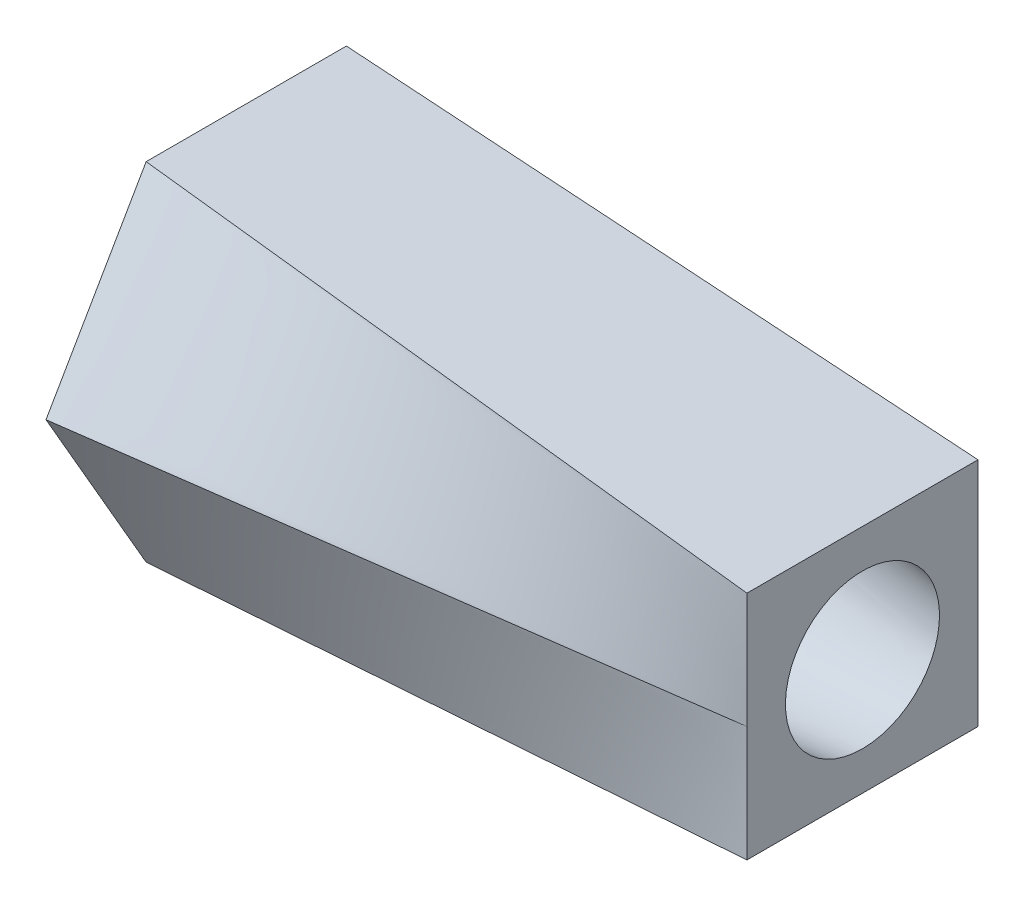
ISO-10303-21;
HEADER;
FILE_DESCRIPTION(('STEP AP214'),'2;1');
FILE_NAME('part.step','',(''),(''),'','','');
FILE_SCHEMA(('AUTOMOTIVE_DESIGN { 1 0 10303 214 1 1 1 1 }'));
ENDSEC;
DATA;
#1=APPLICATION_CONTEXT('core data for automotive mechanical design processes');
#2=APPLICATION_PROTOCOL_DEFINITION('international standard','automotive_design',2000,#1);
#3=PRODUCT_CONTEXT('',#1,'mechanical');
#4=PRODUCT('Part','Part','',(#3));
#5=PRODUCT_RELATED_PRODUCT_CATEGORY('part','',(#4));
#6=PRODUCT_DEFINITION_FORMATION('','',#4);
#7=PRODUCT_DEFINITION_CONTEXT('part definition',#1,'design');
#8=PRODUCT_DEFINITION('design','',#6,#7);
#9=PRODUCT_DEFINITION_SHAPE('','',#8);
#10=(LENGTH_UNIT() NAMED_UNIT(*) SI_UNIT(.MILLI.,.METRE.));
#11=(NAMED_UNIT(*) PLANE_ANGLE_UNIT() SI_UNIT($,.RADIAN.));
#12=(NAMED_UNIT(*) SI_UNIT($,.STERADIAN.) SOLID_ANGLE_UNIT());
#13=UNCERTAINTY_MEASURE_WITH_UNIT(LENGTH_MEASURE(1.E-05),#10,'distance_accuracy_value','');
#14=(GEOMETRIC_REPRESENTATION_CONTEXT(3) GLOBAL_UNCERTAINTY_ASSIGNED_CONTEXT((#13)) GLOBAL_UNIT_ASSIGNED_CONTEXT((#10,
#11,#12)) REPRESENTATION_CONTEXT('',''));
#15=CARTESIAN_POINT('',(0.,0.,0.));
#16=DIRECTION('',(0.,0.,1.));
#17=DIRECTION('',(1.,0.,0.));
#18=AXIS2_PLACEMENT_3D('',#15,#16,#17);
#19=CARTESIAN_POINT('',(0.,0.,0.));
#20=DIRECTION('',(1.,0.,0.));
#21=DIRECTION('',(0.,0.,-1.));
#22=AXIS2_PLACEMENT_3D('',#19,#20,#21);
#23=PLANE('',#22);
#24=CARTESIAN_POINT('',(0.,0.,0.));
#25=DIRECTION('',(-1.,0.,0.));
#26=DIRECTION('',(0.,0.,1.));
#27=AXIS2_PLACEMENT_3D('',#24,#25,#26);
#28=CIRCLE('',#27,50.);
#29=CARTESIAN_POINT('',(0.,3.26493166648178,-49.8932883383447));
#30=VERTEX_POINT('',#29);
#31=EDGE_CURVE('E144',#30,#30,#28,.T.);
#32=ORIENTED_EDGE('',*,*,#31,.F.);
#33=EDGE_LOOP('',(#32));
#34=FACE_BOUND('',#33,.T.);
#35=DIRECTION('',(0.,-0.866025403784438,-0.5));
#36=VECTOR('',#35,1.);
#37=CARTESIAN_POINT('',(0.,0.,65.));
#38=LINE('',#37,#36);
#39=CARTESIAN_POINT('',(0.,0.,65.));
#40=VERTEX_POINT('',#39);
#41=CARTESIAN_POINT('',(0.,-56.2916512459885,32.5));
#42=VERTEX_POINT('',#41);
#43=EDGE_CURVE('E116',#40,#42,#38,.T.);
#44=ORIENTED_EDGE('',*,*,#43,.F.);
#45=DIRECTION('',(0.,-0.866025403784439,0.5));
#46=VECTOR('',#45,1.);
#47=CARTESIAN_POINT('',(0.,56.2916512459885,32.5));
#48=LINE('',#47,#46);
#49=CARTESIAN_POINT('',(0.,56.2916512459885,32.5));
#50=VERTEX_POINT('',#49);
#51=EDGE_CURVE('E12',#50,#40,#48,.T.);
#52=ORIENTED_EDGE('',*,*,#51,.F.);
#53=DIRECTION('',(0.,0.,1.));
#54=VECTOR('',#53,1.);
#55=CARTESIAN_POINT('',(0.,56.2916512459885,-32.5));
#56=LINE('',#55,#54);
#57=CARTESIAN_POINT('',(0.,56.2916512459885,-32.5));
#58=VERTEX_POINT('',#57);
#59=EDGE_CURVE('E65',#58,#50,#56,.T.);
#60=ORIENTED_EDGE('',*,*,#59,.F.);
#61=DIRECTION('',(0.,0.866025403784438,0.500000000000001));
#62=VECTOR('',#61,1.);
#63=CARTESIAN_POINT('',(0.,0.,-65.));
#64=LINE('',#63,#62);
#65=CARTESIAN_POINT('',(0.,0.,-65.));
#66=VERTEX_POINT('',#65);
#67=EDGE_CURVE('E383',#66,#58,#64,.T.);
#68=ORIENTED_EDGE('',*,*,#67,.F.);
#69=DIRECTION('',(0.,0.866025403784439,-0.5));
#70=VECTOR('',#69,1.);
#71=CARTESIAN_POINT('',(0.,-56.2916512459885,-32.5));
#72=LINE('',#71,#70);
#73=CARTESIAN_POINT('',(0.,-56.2916512459885,-32.5));
#74=VERTEX_POINT('',#73);
#75=EDGE_CURVE('E393',#74,#66,#72,.T.);
#76=ORIENTED_EDGE('',*,*,#75,.F.);
#77=DIRECTION('',(0.,0.,-1.));
#78=VECTOR('',#77,1.);
#79=CARTESIAN_POINT('',(0.,-56.2916512459885,32.5));
#80=LINE('',#79,#78);
#81=EDGE_CURVE('E245',#42,#74,#80,.T.);
#82=ORIENTED_EDGE('',*,*,#81,.F.);
#83=EDGE_LOOP('',(#44,#52,#60,#68,#76,#82));
#84=FACE_BOUND('',#83,.T.);
#85=ADVANCED_FACE('F54',(#34,#84),#23,.F.);
#86=CARTESIAN_POINT('',(200.,0.,0.));
#87=DIRECTION('',(-1.,0.,0.));
#88=DIRECTION('',(0.,0.,1.));
#89=AXIS2_PLACEMENT_3D('',#86,#87,#88);
#90=PLANE('',#89);
#91=CARTESIAN_POINT('',(200.,0.,0.));
#92=DIRECTION('',(1.,0.,0.));
#93=DIRECTION('',(0.,0.,-1.));
#94=AXIS2_PLACEMENT_3D('',#91,#92,#93);
#95=CIRCLE('',#94,25.);
#96=CARTESIAN_POINT('',(200.,-8.20188431319086,-23.6162887370779));
#97=VERTEX_POINT('',#96);
#98=EDGE_CURVE('E407',#97,#97,#95,.T.);
#99=ORIENTED_EDGE('',*,*,#98,.F.);
#100=EDGE_LOOP('',(#99));
#101=FACE_BOUND('',#100,.T.);
#102=DIRECTION('',(0.,-1.,0.));
#103=VECTOR('',#102,1.);
#104=CARTESIAN_POINT('',(200.,37.5,37.5));
#105=LINE('',#104,#103);
#106=CARTESIAN_POINT('',(200.,37.5,37.5));
#107=VERTEX_POINT('',#106);
#108=CARTESIAN_POINT('',(200.,0.,37.5));
#109=VERTEX_POINT('',#108);
#110=EDGE_CURVE('E141',#107,#109,#105,.T.);
#111=ORIENTED_EDGE('',*,*,#110,.T.);
#112=CARTESIAN_POINT('',(200.,-37.5,37.5));
#113=VERTEX_POINT('',#112);
#114=EDGE_CURVE('E114',#109,#113,#105,.T.);
#115=ORIENTED_EDGE('',*,*,#114,.T.);
#116=DIRECTION('',(0.,0.,-1.));
#117=VECTOR('',#116,1.);
#118=CARTESIAN_POINT('',(200.,-37.5,-37.5));
#119=LINE('',#118,#117);
#120=CARTESIAN_POINT('',(200.,-37.5,0.));
#121=VERTEX_POINT('',#120);
#122=EDGE_CURVE('E124',#113,#121,#119,.T.);
#123=ORIENTED_EDGE('',*,*,#122,.T.);
#124=CARTESIAN_POINT('',(200.,-37.5,-37.5));
#125=VERTEX_POINT('',#124);
#126=EDGE_CURVE('E134',#121,#125,#119,.T.);
#127=ORIENTED_EDGE('',*,*,#126,.T.);
#128=DIRECTION('',(0.,1.,0.));
#129=VECTOR('',#128,1.);
#130=CARTESIAN_POINT('',(200.,37.5,-37.5));
#131=LINE('',#130,#129);
#132=CARTESIAN_POINT('',(200.,37.5,-37.5));
#133=VERTEX_POINT('',#132);
#134=EDGE_CURVE('E133',#125,#133,#131,.T.);
#135=ORIENTED_EDGE('',*,*,#134,.T.);
#136=DIRECTION('',(0.,0.,1.));
#137=VECTOR('',#136,1.);
#138=CARTESIAN_POINT('',(200.,37.5,-37.5));
#139=LINE('',#138,#137);
#140=EDGE_CURVE('E221',#133,#107,#139,.T.);
#141=ORIENTED_EDGE('',*,*,#140,.T.);
#142=EDGE_LOOP('',(#111,#115,#123,#127,#135,#141));
#143=FACE_BOUND('',#142,.T.);
#144=ADVANCED_FACE('F139',(#101,#143),#90,.F.);
#145=CARTESIAN_POINT('',(200.,37.5,-37.5));
#146=CARTESIAN_POINT('',(0.,56.2916512459885,-32.5));
#147=CARTESIAN_POINT('',(200.,25.,-37.5));
#148=CARTESIAN_POINT('',(0.,46.9097093716571,-37.9166666666667));
#149=CARTESIAN_POINT('',(200.,12.5,-37.5));
#150=CARTESIAN_POINT('',(0.,37.5277674973257,-43.3333333333333));
#151=CARTESIAN_POINT('',(200.,-12.5,-37.5));
#152=CARTESIAN_POINT('',(0.,18.7638837486629,-54.1666666666667));
#153=CARTESIAN_POINT('',(200.,-25.,-37.5));
#154=CARTESIAN_POINT('',(0.,9.38194187433145,-59.5833333333333));
#155=CARTESIAN_POINT('',(200.,-37.5,-37.5));
#156=CARTESIAN_POINT('',(0.,0.,-65.));
#157=B_SPLINE_SURFACE_WITH_KNOTS('',3,1,((#145,#146),(#147,#148),(#149,#150),(#151,#152),(#153,
#154),(#155,#156)),.UNSPECIFIED.,.F.,.F.,.F.,(4,2,4),(2,2),(0.,0.5,1.),(0.,1.),.UNSPECIFIED.);
#158=DIRECTION('',(-0.974017631705002,0.182628305944688,-0.133927424359438));
#159=VECTOR('',#158,1.);
#160=CARTESIAN_POINT('',(100.,-18.75,-51.25));
#161=LINE('',#160,#159);
#162=EDGE_CURVE('E260',#125,#66,#161,.T.);
#163=DIRECTION('',(0.995306672017267,-0.0935172793167699,-0.0248826668004318));
#164=VECTOR('',#163,1.);
#165=CARTESIAN_POINT('',(100.,46.8958256229943,-35.));
#166=LINE('',#165,#164);
#167=EDGE_CURVE('E230',#58,#133,#166,.T.);
#168=ORIENTED_EDGE('',*,*,#134,.F.);
#169=ORIENTED_EDGE('',*,*,#162,.T.);
#170=ORIENTED_EDGE('',*,*,#67,.T.);
#171=ORIENTED_EDGE('',*,*,#167,.T.);
#172=EDGE_LOOP('',(#168,#169,#170,#171));
#173=FACE_BOUND('',#172,.T.);
#174=ADVANCED_FACE('F165',(#173),#157,.T.);
#175=CARTESIAN_POINT('',(200.,-37.5,-37.5));
#176=CARTESIAN_POINT('',(0.,0.,-65.));
#177=CARTESIAN_POINT('',(200.,-37.5,-31.2499999999999));
#178=CARTESIAN_POINT('',(0.,-9.38194187433144,-59.5833333333333));
#179=CARTESIAN_POINT('',(200.,-37.5,-24.9999999999999));
#180=CARTESIAN_POINT('',(0.,-18.7638837486629,-54.1666666666666));
#181=CARTESIAN_POINT('',(200.,-37.5,-12.4999999999999));
#182=CARTESIAN_POINT('',(0.,-37.5277674973258,-43.3333333333333));
#183=CARTESIAN_POINT('',(200.,-37.5,-6.24999999999991));
#184=CARTESIAN_POINT('',(0.,-46.9097093716572,-37.9166666666667));
#185=CARTESIAN_POINT('',(200.,-37.5,0.));
#186=CARTESIAN_POINT('',(0.,-56.2916512459885,-32.5));
#187=B_SPLINE_SURFACE_WITH_KNOTS('',3,1,((#175,#176),(#177,#178),(#179,#180),(#181,#182),(#183,
#184),(#185,#186)),.UNSPECIFIED.,.F.,.F.,.F.,(4,2,4),(2,2),(0.,0.5,1.),(0.,1.),.UNSPECIFIED.);
#188=DIRECTION('',(-0.98283508579197,-0.0923454708226197,-0.159710701441195));
#189=VECTOR('',#188,1.);
#190=CARTESIAN_POINT('',(100.,-46.8958256229943,-16.25));
#191=LINE('',#190,#189);
#192=EDGE_CURVE('E121',#121,#74,#191,.T.);
#193=ORIENTED_EDGE('',*,*,#126,.F.);
#194=ORIENTED_EDGE('',*,*,#192,.T.);
#195=ORIENTED_EDGE('',*,*,#75,.T.);
#196=ORIENTED_EDGE('',*,*,#162,.F.);
#197=EDGE_LOOP('',(#193,#194,#195,#196));
#198=FACE_BOUND('',#197,.T.);
#199=ADVANCED_FACE('F275',(#198),#187,.T.);
#200=CARTESIAN_POINT('',(5.24278131102717,55.7990486562095,0.));
#201=DIRECTION('',(0.0935462432436392,0.995614935793453,0.));
#202=DIRECTION('',(-0.995614935793453,0.0935462432436392,0.));
#203=AXIS2_PLACEMENT_3D('',#200,#201,#202);
#204=PLANE('',#203);
#205=ORIENTED_EDGE('',*,*,#167,.F.);
#206=ORIENTED_EDGE('',*,*,#59,.T.);
#207=DIRECTION('',(-0.995306672017267,0.0935172793167699,-0.0248826668004316));
#208=VECTOR('',#207,1.);
#209=CARTESIAN_POINT('',(100.,46.8958256229943,35.));
#210=LINE('',#209,#208);
#211=EDGE_CURVE('E235',#107,#50,#210,.T.);
#212=ORIENTED_EDGE('',*,*,#211,.F.);
#213=ORIENTED_EDGE('',*,*,#140,.F.);
#214=EDGE_LOOP('',(#205,#206,#212,#213));
#215=FACE_BOUND('',#214,.T.);
#216=ADVANCED_FACE('F239',(#215),#204,.T.);
#217=CARTESIAN_POINT('',(5.24278131102717,-55.7990486562095,0.));
#218=DIRECTION('',(0.0935462432436392,-0.995614935793453,0.));
#219=DIRECTION('',(0.995614935793453,0.0935462432436392,0.));
#220=AXIS2_PLACEMENT_3D('',#217,#218,#219);
#221=PLANE('',#220);
#222=DIRECTION('',(-0.995306672017267,-0.0935172793167699,-0.0248826668004317));
#223=VECTOR('',#222,1.);
#224=CARTESIAN_POINT('',(200.,-37.5,37.5));
#225=LINE('',#224,#223);
#226=EDGE_CURVE('E110',#113,#42,#225,.T.);
#227=ORIENTED_EDGE('',*,*,#226,.T.);
#228=ORIENTED_EDGE('',*,*,#81,.T.);
#229=ORIENTED_EDGE('',*,*,#192,.F.);
#230=ORIENTED_EDGE('',*,*,#122,.F.);
#231=EDGE_LOOP('',(#227,#228,#229,#230));
#232=FACE_BOUND('',#231,.T.);
#233=ADVANCED_FACE('F126',(#232),#221,.T.);
#234=CARTESIAN_POINT('',(200.,-37.5,37.5));
#235=CARTESIAN_POINT('',(0.,-56.2916512459885,32.5));
#236=CARTESIAN_POINT('',(200.,-31.25,37.5));
#237=CARTESIAN_POINT('',(0.,-46.9097093716571,37.9166666666667));
#238=CARTESIAN_POINT('',(200.,-25.,37.5));
#239=CARTESIAN_POINT('',(0.,-37.5277674973257,43.3333333333333));
#240=CARTESIAN_POINT('',(200.,-12.5,37.5));
#241=CARTESIAN_POINT('',(0.,-18.7638837486628,54.1666666666667));
#242=CARTESIAN_POINT('',(200.,-6.25000000000001,37.5));
#243=CARTESIAN_POINT('',(0.,-9.38194187433143,59.5833333333333));
#244=CARTESIAN_POINT('',(200.,0.,37.5));
#245=CARTESIAN_POINT('',(0.,0.,65.));
#246=B_SPLINE_SURFACE_WITH_KNOTS('',3,1,((#234,#235),(#236,#237),(#238,#239),(#240,#241),(#242,
#243),(#244,#245)),.UNSPECIFIED.,.F.,.F.,.F.,(4,2,4),(2,2),(0.,0.5,1.),(0.,1.),.UNSPECIFIED.);
#247=DIRECTION('',(-0.990678839845296,0.,0.136218340478728));
#248=VECTOR('',#247,1.);
#249=CARTESIAN_POINT('',(100.,0.,51.25));
#250=LINE('',#249,#248);
#251=EDGE_CURVE('E73',#109,#40,#250,.T.);
#252=ORIENTED_EDGE('',*,*,#114,.F.);
#253=ORIENTED_EDGE('',*,*,#251,.T.);
#254=ORIENTED_EDGE('',*,*,#43,.T.);
#255=ORIENTED_EDGE('',*,*,#226,.F.);
#256=EDGE_LOOP('',(#252,#253,#254,#255));
#257=FACE_BOUND('',#256,.T.);
#258=ADVANCED_FACE('F112',(#257),#246,.T.);
#259=CARTESIAN_POINT('',(200.,0.,37.5));
#260=CARTESIAN_POINT('',(0.,0.,65.));
#261=CARTESIAN_POINT('',(200.,6.24999999999999,37.5));
#262=CARTESIAN_POINT('',(0.,9.38194187433145,59.5833333333333));
#263=CARTESIAN_POINT('',(200.,12.5,37.5));
#264=CARTESIAN_POINT('',(0.,18.7638837486629,54.1666666666667));
#265=CARTESIAN_POINT('',(200.,25.,37.5));
#266=CARTESIAN_POINT('',(0.,37.5277674973258,43.3333333333333));
#267=CARTESIAN_POINT('',(200.,31.25,37.5));
#268=CARTESIAN_POINT('',(0.,46.9097093716572,37.9166666666667));
#269=CARTESIAN_POINT('',(200.,37.5,37.5));
#270=CARTESIAN_POINT('',(0.,56.2916512459885,32.5));
#271=B_SPLINE_SURFACE_WITH_KNOTS('',3,1,((#259,#260),(#261,#262),(#263,#264),(#265,#266),(#267,
#268),(#269,#270)),.UNSPECIFIED.,.F.,.F.,.F.,(4,2,4),(2,2),(0.,0.5,1.),(0.,1.),.UNSPECIFIED.);
#272=ORIENTED_EDGE('',*,*,#110,.F.);
#273=ORIENTED_EDGE('',*,*,#211,.T.);
#274=ORIENTED_EDGE('',*,*,#51,.T.);
#275=ORIENTED_EDGE('',*,*,#251,.F.);
#276=EDGE_LOOP('',(#272,#273,#274,#275));
#277=FACE_BOUND('',#276,.T.);
#278=ADVANCED_FACE('F234',(#277),#271,.T.);
#279=CARTESIAN_POINT('',(200.,-8.20188431319086,-23.6162887370779));
#280=CARTESIAN_POINT('',(0.,3.26493166648178,-49.8932883383447));
#281=CARTESIAN_POINT('',(200.,-55.4344617873467,-7.21252011069621));
#282=CARTESIAN_POINT('',(0.,-96.5216450102076,-56.4231516713083));
#283=CARTESIAN_POINT('',(200.,-39.030693160965,40.0200573634596));
#284=CARTESIAN_POINT('',(0.,-103.051508343171,43.3634250053811));
#285=CARTESIAN_POINT('',(200.,8.20188431319086,23.6162887370779));
#286=CARTESIAN_POINT('',(0.,-3.26493166648181,49.8932883383447));
#287=CARTESIAN_POINT('',(200.,55.4344617873467,7.21252011069622));
#288=CARTESIAN_POINT('',(0.,96.5216450102076,56.4231516713083));
#289=CARTESIAN_POINT('',(200.,39.030693160965,-40.0200573634596));
#290=CARTESIAN_POINT('',(0.,103.051508343171,-43.3634250053811));
#291=CARTESIAN_POINT('',(200.,-8.20188431319086,-23.6162887370779));
#292=CARTESIAN_POINT('',(0.,3.26493166648178,-49.8932883383447));
#293=(BOUNDED_SURFACE() B_SPLINE_SURFACE(3,1,((#279,#280),(#281,#282),(#283,#284),(#285,#286),
(#287,#288),(#289,#290),(#291,#292)),.UNSPECIFIED.,.T.,.F.,.F.) B_SPLINE_SURFACE_WITH_KNOTS((4,
3,4),(2,2),(0.,0.5,1.),(0.,1.),
.UNSPECIFIED.) GEOMETRIC_REPRESENTATION_ITEM() RATIONAL_B_SPLINE_SURFACE(((1.,1.),
(0.333333333333333,0.333333333333334),(0.333333333333333,0.333333333333334),(1.,1.),
(0.333333333333333,0.333333333333333),(0.333333333333333,0.333333333333333),(1.,1.))) REPRESENTATION_ITEM('') SURFACE());
#294=CARTESIAN_POINT('',(200.,-8.20188431319086,-23.6162887370779));
#295=CARTESIAN_POINT('',(197.916666666667,-8.0824383134026,-23.8900074829245));
#296=CARTESIAN_POINT('',(195.833333333333,-7.96299231361435,-24.163726228771));
#297=CARTESIAN_POINT('',(191.666666666667,-7.72410031403783,-24.711163720464));
#298=CARTESIAN_POINT('',(189.583333333333,-7.60465431424958,-24.9848824663106));
#299=CARTESIAN_POINT('',(185.416666666667,-7.36576231467306,-25.5323199580036));
#300=CARTESIAN_POINT('',(183.333333333333,-7.24631631488481,-25.8060387038502));
#301=CARTESIAN_POINT('',(179.166666666667,-7.00742431530829,-26.3534761955432));
#302=CARTESIAN_POINT('',(177.083333333333,-6.88797831552004,-26.6271949413897));
#303=CARTESIAN_POINT('',(172.916666666667,-6.64908631594352,-27.1746324330828));
#304=CARTESIAN_POINT('',(170.833333333333,-6.52964031615527,-27.4483511789293));
#305=CARTESIAN_POINT('',(166.666666666667,-6.29074831657875,-27.9957886706224));
#306=CARTESIAN_POINT('',(164.583333333333,-6.1713023167905,-28.2695074164689));
#307=CARTESIAN_POINT('',(160.416666666667,-5.93241031721398,-28.816944908162));
#308=CARTESIAN_POINT('',(158.333333333333,-5.81296431742573,-29.0906636540085));
#309=CARTESIAN_POINT('',(154.166666666667,-5.57407231784921,-29.6381011457016));
#310=CARTESIAN_POINT('',(152.083333333333,-5.45462631806096,-29.9118198915481));
#311=CARTESIAN_POINT('',(147.916666666667,-5.21573431848444,-30.4592573832412));
#312=CARTESIAN_POINT('',(145.833333333333,-5.09628831869619,-30.7329761290877));
#313=CARTESIAN_POINT('',(141.666666666667,-4.85739631911967,-31.2804136207807));
#314=CARTESIAN_POINT('',(139.583333333333,-4.73795031933142,-31.5541323666273));
#315=CARTESIAN_POINT('',(135.416666666667,-4.4990583197549,-32.1015698583203));
#316=CARTESIAN_POINT('',(133.333333333333,-4.37961231996665,-32.3752886041669));
#317=CARTESIAN_POINT('',(129.166666666667,-4.14072032039013,-32.9227260958599));
#318=CARTESIAN_POINT('',(127.083333333333,-4.02127432060188,-33.1964448417064));
#319=CARTESIAN_POINT('',(122.916666666667,-3.78238232102536,-33.7438823333995));
#320=CARTESIAN_POINT('',(120.833333333333,-3.66293632123711,-34.017601079246));
#321=CARTESIAN_POINT('',(116.666666666667,-3.42404432166059,-34.5650385709391));
#322=CARTESIAN_POINT('',(114.583333333333,-3.30459832187234,-34.8387573167856));
#323=CARTESIAN_POINT('',(110.416666666667,-3.06570632229582,-35.3861948084787));
#324=CARTESIAN_POINT('',(108.333333333333,-2.94626032250757,-35.6599135543252));
#325=CARTESIAN_POINT('',(104.166666666667,-2.70736832293105,-36.2073510460183));
#326=CARTESIAN_POINT('',(102.083333333333,-2.5879223231428,-36.4810697918648));
#327=CARTESIAN_POINT('',(97.9166666666667,-2.34903032356628,-37.0285072835578));
#328=CARTESIAN_POINT('',(95.8333333333333,-2.22958432377803,-37.3022260294044));
#329=CARTESIAN_POINT('',(91.6666666666667,-1.99069232420151,-37.8496635210974));
#330=CARTESIAN_POINT('',(89.5833333333333,-1.87124632441326,-38.123382266944));
#331=CARTESIAN_POINT('',(85.4166666666667,-1.63235432483674,-38.670819758637));
#332=CARTESIAN_POINT('',(83.3333333333333,-1.51290832504849,-38.9445385044836));
#333=CARTESIAN_POINT('',(79.1666666666667,-1.27401632547197,-39.4919759961766));
#334=CARTESIAN_POINT('',(77.0833333333333,-1.15457032568372,-39.7656947420231));
#335=CARTESIAN_POINT('',(72.9166666666667,-0.915678326107202,-40.3131322337162));
#336=CARTESIAN_POINT('',(70.8333333333333,-0.796232326318945,-40.5868509795627));
#337=CARTESIAN_POINT('',(66.6666666666667,-0.557340326742432,-41.1342884712558));
#338=CARTESIAN_POINT('',(64.5833333333333,-0.437894326954176,-41.4080072171023));
#339=CARTESIAN_POINT('',(60.4166666666667,-0.199002327377663,-41.9554447087954));
#340=CARTESIAN_POINT('',(58.3333333333333,-0.0795563275894056,-42.2291634546419));
#341=CARTESIAN_POINT('',(54.1666666666667,0.159335671987108,-42.776600946335));
#342=CARTESIAN_POINT('',(52.0833333333333,0.278781671775365,-43.0503196921815));
#343=CARTESIAN_POINT('',(47.9166666666667,0.517673671351878,-43.5977571838745));
#344=CARTESIAN_POINT('',(45.8333333333333,0.637119671140135,-43.8714759297211));
#345=CARTESIAN_POINT('',(41.6666666666667,0.876011670716648,-44.4189134214141));
#346=CARTESIAN_POINT('',(39.5833333333333,0.995457670504905,-44.6926321672607));
#347=CARTESIAN_POINT('',(35.4166666666667,1.23434967008142,-45.2400696589537));
#348=CARTESIAN_POINT('',(33.3333333333333,1.35379566986967,-45.5137884048003));
#349=CARTESIAN_POINT('',(29.1666666666667,1.59268766944619,-46.0612258964933));
#350=CARTESIAN_POINT('',(27.0833333333333,1.71213366923444,-46.3349446423398));
#351=CARTESIAN_POINT('',(22.9166666666667,1.95102566881096,-46.8823821340329));
#352=CARTESIAN_POINT('',(20.8333333333333,2.07047166859922,-47.1561008798794));
#353=CARTESIAN_POINT('',(16.6666666666667,2.30936366817573,-47.7035383715725));
#354=CARTESIAN_POINT('',(14.5833333333333,2.42880966796398,-47.977257117419));
#355=CARTESIAN_POINT('',(10.4166666666667,2.6677016675405,-48.5246946091121));
#356=CARTESIAN_POINT('',(8.33333333333334,2.78714766732875,-48.7984133549586));
#357=CARTESIAN_POINT('',(4.16666666666667,3.02603966690527,-49.3458508466517));
#358=CARTESIAN_POINT('',(2.08333333333333,3.14548566669353,-49.6195695924982));
#359=CARTESIAN_POINT('',(0.,3.26493166648178,-49.8932883383447));
#360=B_SPLINE_CURVE_WITH_KNOTS('',3,(#294,#295,#296,#297,#298,#299,#300,#301,#302,#303,#304,
#305,#306,#307,#308,#309,#310,#311,#312,#313,#314,#315,#316,#317,#318,#319,#320,#321,#322,#323,
#324,#325,#326,#327,#328,#329,#330,#331,#332,#333,#334,#335,#336,#337,#338,#339,#340,#341,#342,
#343,#344,#345,#346,#347,#348,#349,#350,#351,#352,#353,#354,#355,#356,#357,#358,#359),
.UNSPECIFIED.,.F.,.F.,(4,2,2,2,2,2,2,2,2,2,2,2,2,2,2,2,2,2,2,2,2,2,2,2,2,2,2,2,2,2,2,2,4),(0.,
6.31388974311707,12.6277794862341,18.9416692293512,25.2555589724683,31.5694487155853,
37.8833384587024,44.1972282018195,50.5111179449365,56.8250076880536,63.1388974311707,
69.4527871742877,75.7666769174048,82.0805666605219,88.3944564036389,94.708346146756,
101.022235889873,107.33612563299,113.650015376107,119.963905119224,126.277794862341,
132.591684605458,138.905574348575,145.219464091693,151.53335383481,157.847243577927,
164.161133321044,170.475023064161,176.788912807278,183.102802550395,189.416692293512,
195.730582036629,202.044471779746),.UNSPECIFIED.);
#361=EDGE_CURVE('BSEAM167',#97,#30,#360,.T.);
#362=ORIENTED_EDGE('',*,*,#98,.T.);
#363=ORIENTED_EDGE('',*,*,#31,.T.);
#364=ORIENTED_EDGE('',*,*,#361,.T.);
#365=ORIENTED_EDGE('',*,*,#361,.F.);
#366=EDGE_LOOP('',(#362,#364,#363,#365));
#367=FACE_BOUND('',#366,.T.);
#368=ADVANCED_FACE('F167',(#367),#293,.F.);
#369=CLOSED_SHELL('',(#85,#144,#174,#199,#216,#233,#258,#278,#368));
#370=MANIFOLD_SOLID_BREP('B2',#369);
#371=ADVANCED_BREP_SHAPE_REPRESENTATION('',(#18,#370),#14);
#372=SHAPE_DEFINITION_REPRESENTATION(#9,#371);
ENDSEC;
END-ISO-10303-21;
